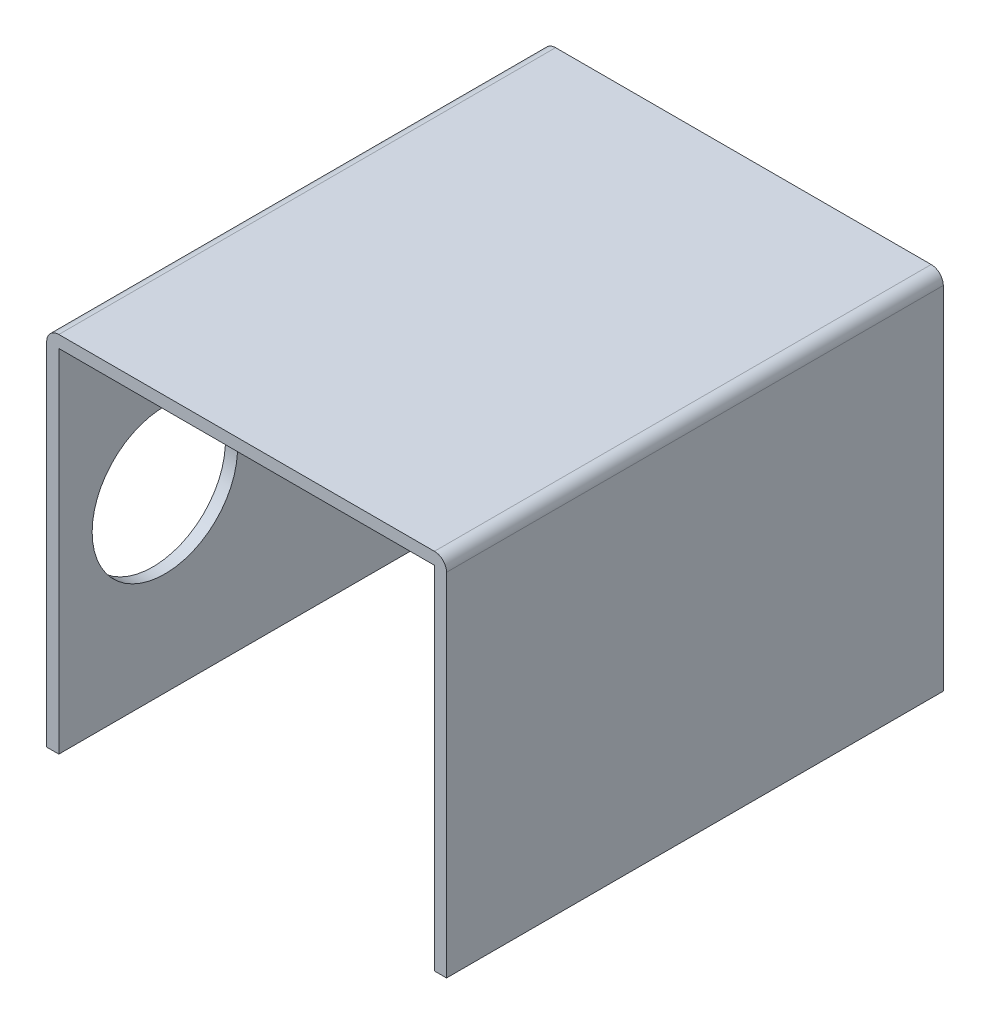
ISO-10303-21;
HEADER;
FILE_DESCRIPTION(('STEP AP214'),'2;1');
FILE_NAME('part.step','',(''),(''),'','','');
FILE_SCHEMA(('AUTOMOTIVE_DESIGN { 1 0 10303 214 1 1 1 1 }'));
ENDSEC;
DATA;
#1=APPLICATION_CONTEXT('core data for automotive mechanical design processes');
#2=APPLICATION_PROTOCOL_DEFINITION('international standard','automotive_design',2000,#1);
#3=PRODUCT_CONTEXT('',#1,'mechanical');
#4=PRODUCT('Part','Part','',(#3));
#5=PRODUCT_RELATED_PRODUCT_CATEGORY('part','',(#4));
#6=PRODUCT_DEFINITION_FORMATION('','',#4);
#7=PRODUCT_DEFINITION_CONTEXT('part definition',#1,'design');
#8=PRODUCT_DEFINITION('design','',#6,#7);
#9=PRODUCT_DEFINITION_SHAPE('','',#8);
#10=(LENGTH_UNIT() NAMED_UNIT(*) SI_UNIT(.MILLI.,.METRE.));
#11=(NAMED_UNIT(*) PLANE_ANGLE_UNIT() SI_UNIT($,.RADIAN.));
#12=(NAMED_UNIT(*) SI_UNIT($,.STERADIAN.) SOLID_ANGLE_UNIT());
#13=UNCERTAINTY_MEASURE_WITH_UNIT(LENGTH_MEASURE(1.E-05),#10,'distance_accuracy_value','');
#14=(GEOMETRIC_REPRESENTATION_CONTEXT(3) GLOBAL_UNCERTAINTY_ASSIGNED_CONTEXT((#13)) GLOBAL_UNIT_ASSIGNED_CONTEXT((#10,
#11,#12)) REPRESENTATION_CONTEXT('',''));
#15=CARTESIAN_POINT('',(0.,0.,0.));
#16=DIRECTION('',(0.,0.,1.));
#17=DIRECTION('',(1.,0.,0.));
#18=AXIS2_PLACEMENT_3D('',#15,#16,#17);
#19=CARTESIAN_POINT('',(32.,29.,41.));
#20=DIRECTION('',(1.,0.,0.));
#21=DIRECTION('',(0.,0.,-1.));
#22=AXIS2_PLACEMENT_3D('',#19,#20,#21);
#23=PLANE('',#22);
#24=DIRECTION('',(0.,1.,0.));
#25=VECTOR('',#24,1.);
#26=CARTESIAN_POINT('',(32.,29.,0.));
#27=LINE('',#26,#25);
#28=CARTESIAN_POINT('',(32.,29.,0.));
#29=VERTEX_POINT('',#28);
#30=CARTESIAN_POINT('',(32.,0.,0.));
#31=VERTEX_POINT('',#30);
#32=EDGE_CURVE('E144',#29,#31,#27,.F.);
#33=ORIENTED_EDGE('',*,*,#32,.T.);
#34=DIRECTION('',(0.,0.,-1.));
#35=VECTOR('',#34,1.);
#36=CARTESIAN_POINT('',(32.,0.,41.));
#37=LINE('',#36,#35);
#38=CARTESIAN_POINT('',(32.,0.,41.));
#39=VERTEX_POINT('',#38);
#40=EDGE_CURVE('E11',#39,#31,#37,.T.);
#41=ORIENTED_EDGE('',*,*,#40,.F.);
#42=DIRECTION('',(0.,1.,0.));
#43=VECTOR('',#42,1.);
#44=CARTESIAN_POINT('',(32.,29.,41.));
#45=LINE('',#44,#43);
#46=CARTESIAN_POINT('',(32.,29.,41.));
#47=VERTEX_POINT('',#46);
#48=EDGE_CURVE('E96',#47,#39,#45,.F.);
#49=ORIENTED_EDGE('',*,*,#48,.F.);
#50=DIRECTION('',(0.,0.,-1.));
#51=VECTOR('',#50,1.);
#52=CARTESIAN_POINT('',(32.,29.,41.));
#53=LINE('',#52,#51);
#54=EDGE_CURVE('E143',#47,#29,#53,.T.);
#55=ORIENTED_EDGE('',*,*,#54,.T.);
#56=EDGE_LOOP('',(#33,#41,#49,#55));
#57=FACE_BOUND('',#56,.T.);
#58=ADVANCED_FACE('F33',(#57),#23,.F.);
#59=CARTESIAN_POINT('',(33.,0.,41.));
#60=DIRECTION('',(0.,-1.,0.));
#61=DIRECTION('',(0.,0.,-1.));
#62=AXIS2_PLACEMENT_3D('',#59,#60,#61);
#63=PLANE('',#62);
#64=DIRECTION('',(-1.,0.,0.));
#65=VECTOR('',#64,1.);
#66=CARTESIAN_POINT('',(33.,0.,0.));
#67=LINE('',#66,#65);
#68=CARTESIAN_POINT('',(33.,0.,0.));
#69=VERTEX_POINT('',#68);
#70=EDGE_CURVE('E147',#69,#31,#67,.T.);
#71=ORIENTED_EDGE('',*,*,#70,.F.);
#72=DIRECTION('',(0.,0.,-1.));
#73=VECTOR('',#72,1.);
#74=CARTESIAN_POINT('',(33.,0.,41.));
#75=LINE('',#74,#73);
#76=CARTESIAN_POINT('',(33.,0.,41.));
#77=VERTEX_POINT('',#76);
#78=EDGE_CURVE('E42',#77,#69,#75,.T.);
#79=ORIENTED_EDGE('',*,*,#78,.F.);
#80=DIRECTION('',(-1.,0.,0.));
#81=VECTOR('',#80,1.);
#82=CARTESIAN_POINT('',(33.,0.,41.));
#83=LINE('',#82,#81);
#84=EDGE_CURVE('E193',#77,#39,#83,.T.);
#85=ORIENTED_EDGE('',*,*,#84,.T.);
#86=ORIENTED_EDGE('',*,*,#40,.T.);
#87=EDGE_LOOP('',(#71,#79,#85,#86));
#88=FACE_BOUND('',#87,.T.);
#89=ADVANCED_FACE('F231',(#88),#63,.T.);
#90=CARTESIAN_POINT('',(33.,29.,41.));
#91=DIRECTION('',(1.,0.,0.));
#92=DIRECTION('',(0.,0.,-1.));
#93=AXIS2_PLACEMENT_3D('',#90,#91,#92);
#94=PLANE('',#93);
#95=DIRECTION('',(0.,-1.,0.));
#96=VECTOR('',#95,1.);
#97=CARTESIAN_POINT('',(33.,29.,0.));
#98=LINE('',#97,#96);
#99=CARTESIAN_POINT('',(33.,29.,0.));
#100=VERTEX_POINT('',#99);
#101=EDGE_CURVE('E151',#100,#69,#98,.T.);
#102=ORIENTED_EDGE('',*,*,#101,.F.);
#103=DIRECTION('',(0.,0.,-1.));
#104=VECTOR('',#103,1.);
#105=CARTESIAN_POINT('',(33.,29.,41.));
#106=LINE('',#105,#104);
#107=CARTESIAN_POINT('',(33.,29.,41.));
#108=VERTEX_POINT('',#107);
#109=EDGE_CURVE('E178',#108,#100,#106,.T.);
#110=ORIENTED_EDGE('',*,*,#109,.F.);
#111=DIRECTION('',(0.,-1.,0.));
#112=VECTOR('',#111,1.);
#113=CARTESIAN_POINT('',(33.,29.,41.));
#114=LINE('',#113,#112);
#115=EDGE_CURVE('E196',#108,#77,#114,.T.);
#116=ORIENTED_EDGE('',*,*,#115,.T.);
#117=ORIENTED_EDGE('',*,*,#78,.T.);
#118=EDGE_LOOP('',(#102,#110,#116,#117));
#119=FACE_BOUND('',#118,.T.);
#120=ADVANCED_FACE('F235',(#119),#94,.T.);
#121=CARTESIAN_POINT('',(32.,29.,41.));
#122=DIRECTION('',(0.,0.,-1.));
#123=DIRECTION('',(-1.,0.,0.));
#124=AXIS2_PLACEMENT_3D('',#121,#122,#123);
#125=CYLINDRICAL_SURFACE('',#124,1.);
#126=CARTESIAN_POINT('',(32.,29.,0.));
#127=DIRECTION('',(0.,0.,-1.));
#128=DIRECTION('',(-1.,0.,0.));
#129=AXIS2_PLACEMENT_3D('',#126,#127,#128);
#130=CIRCLE('',#129,1.);
#131=CARTESIAN_POINT('',(32.,30.,0.));
#132=VERTEX_POINT('',#131);
#133=EDGE_CURVE('E154',#132,#100,#130,.T.);
#134=ORIENTED_EDGE('',*,*,#133,.F.);
#135=DIRECTION('',(0.,0.,-1.));
#136=VECTOR('',#135,1.);
#137=CARTESIAN_POINT('',(32.,30.,41.));
#138=LINE('',#137,#136);
#139=CARTESIAN_POINT('',(32.,30.,41.));
#140=VERTEX_POINT('',#139);
#141=EDGE_CURVE('E176',#140,#132,#138,.T.);
#142=ORIENTED_EDGE('',*,*,#141,.F.);
#143=CARTESIAN_POINT('',(32.,29.,41.));
#144=DIRECTION('',(0.,0.,-1.));
#145=DIRECTION('',(-1.,0.,0.));
#146=AXIS2_PLACEMENT_3D('',#143,#144,#145);
#147=CIRCLE('',#146,1.);
#148=EDGE_CURVE('E199',#140,#108,#147,.T.);
#149=ORIENTED_EDGE('',*,*,#148,.T.);
#150=ORIENTED_EDGE('',*,*,#109,.T.);
#151=EDGE_LOOP('',(#134,#142,#149,#150));
#152=FACE_BOUND('',#151,.T.);
#153=ADVANCED_FACE('F240',(#152),#125,.T.);
#154=CARTESIAN_POINT('',(1.00000000000001,30.,41.));
#155=DIRECTION('',(0.,1.,0.));
#156=DIRECTION('',(0.,0.,1.));
#157=AXIS2_PLACEMENT_3D('',#154,#155,#156);
#158=PLANE('',#157);
#159=DIRECTION('',(1.,0.,0.));
#160=VECTOR('',#159,1.);
#161=CARTESIAN_POINT('',(1.00000000000001,30.,0.));
#162=LINE('',#161,#160);
#163=CARTESIAN_POINT('',(1.00000000000001,30.,0.));
#164=VERTEX_POINT('',#163);
#165=EDGE_CURVE('E157',#164,#132,#162,.T.);
#166=ORIENTED_EDGE('',*,*,#165,.F.);
#167=DIRECTION('',(0.,0.,-1.));
#168=VECTOR('',#167,1.);
#169=CARTESIAN_POINT('',(1.00000000000001,30.,41.));
#170=LINE('',#169,#168);
#171=CARTESIAN_POINT('',(1.00000000000001,30.,41.));
#172=VERTEX_POINT('',#171);
#173=EDGE_CURVE('E174',#172,#164,#170,.T.);
#174=ORIENTED_EDGE('',*,*,#173,.F.);
#175=DIRECTION('',(1.,0.,0.));
#176=VECTOR('',#175,1.);
#177=CARTESIAN_POINT('',(1.00000000000001,30.,41.));
#178=LINE('',#177,#176);
#179=EDGE_CURVE('E202',#172,#140,#178,.T.);
#180=ORIENTED_EDGE('',*,*,#179,.T.);
#181=ORIENTED_EDGE('',*,*,#141,.T.);
#182=EDGE_LOOP('',(#166,#174,#180,#181));
#183=FACE_BOUND('',#182,.T.);
#184=ADVANCED_FACE('F246',(#183),#158,.T.);
#185=CARTESIAN_POINT('',(1.,29.,41.));
#186=DIRECTION('',(0.,0.,-1.));
#187=DIRECTION('',(-1.,0.,0.));
#188=AXIS2_PLACEMENT_3D('',#185,#186,#187);
#189=CYLINDRICAL_SURFACE('',#188,1.);
#190=CARTESIAN_POINT('',(1.,29.,0.));
#191=DIRECTION('',(0.,0.,-1.));
#192=DIRECTION('',(-1.,0.,0.));
#193=AXIS2_PLACEMENT_3D('',#190,#191,#192);
#194=CIRCLE('',#193,1.);
#195=CARTESIAN_POINT('',(0.,29.,0.));
#196=VERTEX_POINT('',#195);
#197=EDGE_CURVE('E160',#196,#164,#194,.T.);
#198=ORIENTED_EDGE('',*,*,#197,.F.);
#199=DIRECTION('',(0.,0.,-1.));
#200=VECTOR('',#199,1.);
#201=CARTESIAN_POINT('',(0.,29.,41.));
#202=LINE('',#201,#200);
#203=CARTESIAN_POINT('',(0.,29.,41.));
#204=VERTEX_POINT('',#203);
#205=EDGE_CURVE('E172',#204,#196,#202,.T.);
#206=ORIENTED_EDGE('',*,*,#205,.F.);
#207=CARTESIAN_POINT('',(1.,29.,41.));
#208=DIRECTION('',(0.,0.,-1.));
#209=DIRECTION('',(-1.,0.,0.));
#210=AXIS2_PLACEMENT_3D('',#207,#208,#209);
#211=CIRCLE('',#210,1.);
#212=EDGE_CURVE('E138',#204,#172,#211,.T.);
#213=ORIENTED_EDGE('',*,*,#212,.T.);
#214=ORIENTED_EDGE('',*,*,#173,.T.);
#215=EDGE_LOOP('',(#198,#206,#213,#214));
#216=FACE_BOUND('',#215,.T.);
#217=ADVANCED_FACE('F207',(#216),#189,.T.);
#218=CARTESIAN_POINT('',(0.,0.,41.));
#219=DIRECTION('',(-1.,0.,0.));
#220=DIRECTION('',(0.,0.,1.));
#221=AXIS2_PLACEMENT_3D('',#218,#219,#220);
#222=PLANE('',#221);
#223=CARTESIAN_POINT('',(0.,14.5,32.25));
#224=DIRECTION('',(-1.,0.,0.));
#225=DIRECTION('',(0.,0.,1.));
#226=AXIS2_PLACEMENT_3D('',#223,#224,#225);
#227=CIRCLE('',#226,6.);
#228=CARTESIAN_POINT('',(0.,14.5,38.25));
#229=VERTEX_POINT('',#228);
#230=EDGE_CURVE('E189',#229,#229,#227,.T.);
#231=ORIENTED_EDGE('',*,*,#230,.F.);
#232=EDGE_LOOP('',(#231));
#233=FACE_BOUND('',#232,.T.);
#234=CARTESIAN_POINT('',(0.,14.5,8.75));
#235=DIRECTION('',(1.,0.,0.));
#236=DIRECTION('',(0.,0.,-1.));
#237=AXIS2_PLACEMENT_3D('',#234,#235,#236);
#238=CIRCLE('',#237,3.);
#239=CARTESIAN_POINT('',(0.,14.5,5.75));
#240=VERTEX_POINT('',#239);
#241=EDGE_CURVE('E181',#240,#240,#238,.T.);
#242=ORIENTED_EDGE('',*,*,#241,.T.);
#243=EDGE_LOOP('',(#242));
#244=FACE_BOUND('',#243,.T.);
#245=DIRECTION('',(0.,1.,0.));
#246=VECTOR('',#245,1.);
#247=CARTESIAN_POINT('',(0.,0.,0.));
#248=LINE('',#247,#246);
#249=CARTESIAN_POINT('',(0.,0.,0.));
#250=VERTEX_POINT('',#249);
#251=EDGE_CURVE('E163',#250,#196,#248,.T.);
#252=ORIENTED_EDGE('',*,*,#251,.F.);
#253=DIRECTION('',(0.,0.,-1.));
#254=VECTOR('',#253,1.);
#255=CARTESIAN_POINT('',(0.,0.,41.));
#256=LINE('',#255,#254);
#257=CARTESIAN_POINT('',(0.,0.,41.));
#258=VERTEX_POINT('',#257);
#259=EDGE_CURVE('E126',#258,#250,#256,.T.);
#260=ORIENTED_EDGE('',*,*,#259,.F.);
#261=DIRECTION('',(0.,1.,0.));
#262=VECTOR('',#261,1.);
#263=CARTESIAN_POINT('',(0.,0.,41.));
#264=LINE('',#263,#262);
#265=EDGE_CURVE('E136',#258,#204,#264,.T.);
#266=ORIENTED_EDGE('',*,*,#265,.T.);
#267=ORIENTED_EDGE('',*,*,#205,.T.);
#268=EDGE_LOOP('',(#252,#260,#266,#267));
#269=FACE_BOUND('',#268,.T.);
#270=ADVANCED_FACE('F213',(#233,#244,#269),#222,.T.);
#271=CARTESIAN_POINT('',(1.,0.,41.));
#272=DIRECTION('',(0.,-1.,0.));
#273=DIRECTION('',(0.,0.,-1.));
#274=AXIS2_PLACEMENT_3D('',#271,#272,#273);
#275=PLANE('',#274);
#276=DIRECTION('',(-1.,0.,0.));
#277=VECTOR('',#276,1.);
#278=CARTESIAN_POINT('',(1.,0.,0.));
#279=LINE('',#278,#277);
#280=CARTESIAN_POINT('',(1.,0.,0.));
#281=VERTEX_POINT('',#280);
#282=EDGE_CURVE('E125',#281,#250,#279,.T.);
#283=ORIENTED_EDGE('',*,*,#282,.F.);
#284=DIRECTION('',(0.,0.,-1.));
#285=VECTOR('',#284,1.);
#286=CARTESIAN_POINT('',(1.,0.,41.));
#287=LINE('',#286,#285);
#288=CARTESIAN_POINT('',(1.,0.,41.));
#289=VERTEX_POINT('',#288);
#290=EDGE_CURVE('E119',#289,#281,#287,.T.);
#291=ORIENTED_EDGE('',*,*,#290,.F.);
#292=DIRECTION('',(-1.,0.,0.));
#293=VECTOR('',#292,1.);
#294=CARTESIAN_POINT('',(1.,0.,41.));
#295=LINE('',#294,#293);
#296=EDGE_CURVE('E123',#289,#258,#295,.T.);
#297=ORIENTED_EDGE('',*,*,#296,.T.);
#298=ORIENTED_EDGE('',*,*,#259,.T.);
#299=EDGE_LOOP('',(#283,#291,#297,#298));
#300=FACE_BOUND('',#299,.T.);
#301=ADVANCED_FACE('F121',(#300),#275,.T.);
#302=CARTESIAN_POINT('',(1.,0.,41.));
#303=DIRECTION('',(-1.,0.,0.));
#304=DIRECTION('',(0.,0.,1.));
#305=AXIS2_PLACEMENT_3D('',#302,#303,#304);
#306=PLANE('',#305);
#307=CARTESIAN_POINT('',(1.,14.5,32.25));
#308=DIRECTION('',(-1.,0.,0.));
#309=DIRECTION('',(0.,0.,1.));
#310=AXIS2_PLACEMENT_3D('',#307,#308,#309);
#311=CIRCLE('',#310,6.);
#312=CARTESIAN_POINT('',(1.,14.5,38.25));
#313=VERTEX_POINT('',#312);
#314=EDGE_CURVE('E36',#313,#313,#311,.T.);
#315=ORIENTED_EDGE('',*,*,#314,.T.);
#316=EDGE_LOOP('',(#315));
#317=FACE_BOUND('',#316,.T.);
#318=CARTESIAN_POINT('',(1.,14.5,8.75));
#319=DIRECTION('',(-1.,0.,0.));
#320=DIRECTION('',(0.,0.,1.));
#321=AXIS2_PLACEMENT_3D('',#318,#319,#320);
#322=CIRCLE('',#321,3.);
#323=CARTESIAN_POINT('',(1.,14.5,11.75));
#324=VERTEX_POINT('',#323);
#325=EDGE_CURVE('E148',#324,#324,#322,.F.);
#326=ORIENTED_EDGE('',*,*,#325,.F.);
#327=EDGE_LOOP('',(#326));
#328=FACE_BOUND('',#327,.T.);
#329=DIRECTION('',(0.,1.,0.));
#330=VECTOR('',#329,1.);
#331=CARTESIAN_POINT('',(1.,0.,0.));
#332=LINE('',#331,#330);
#333=CARTESIAN_POINT('',(1.,29.,0.));
#334=VERTEX_POINT('',#333);
#335=EDGE_CURVE('E84',#281,#334,#332,.T.);
#336=ORIENTED_EDGE('',*,*,#335,.T.);
#337=DIRECTION('',(0.,0.,-1.));
#338=VECTOR('',#337,1.);
#339=CARTESIAN_POINT('',(1.,29.,41.));
#340=LINE('',#339,#338);
#341=CARTESIAN_POINT('',(1.,29.,41.));
#342=VERTEX_POINT('',#341);
#343=EDGE_CURVE('E127',#342,#334,#340,.T.);
#344=ORIENTED_EDGE('',*,*,#343,.F.);
#345=DIRECTION('',(0.,1.,0.));
#346=VECTOR('',#345,1.);
#347=CARTESIAN_POINT('',(1.,0.,41.));
#348=LINE('',#347,#346);
#349=EDGE_CURVE('E129',#289,#342,#348,.T.);
#350=ORIENTED_EDGE('',*,*,#349,.F.);
#351=ORIENTED_EDGE('',*,*,#290,.T.);
#352=EDGE_LOOP('',(#336,#344,#350,#351));
#353=FACE_BOUND('',#352,.T.);
#354=ADVANCED_FACE('F130',(#317,#328,#353),#306,.F.);
#355=CARTESIAN_POINT('',(1.00000000000001,29.,41.));
#356=DIRECTION('',(0.,1.,0.));
#357=DIRECTION('',(0.,0.,1.));
#358=AXIS2_PLACEMENT_3D('',#355,#356,#357);
#359=PLANE('',#358);
#360=DIRECTION('',(1.,0.,0.));
#361=VECTOR('',#360,1.);
#362=CARTESIAN_POINT('',(1.00000000000001,29.,0.));
#363=LINE('',#362,#361);
#364=EDGE_CURVE('E90',#334,#29,#363,.T.);
#365=ORIENTED_EDGE('',*,*,#364,.T.);
#366=ORIENTED_EDGE('',*,*,#54,.F.);
#367=DIRECTION('',(1.,0.,0.));
#368=VECTOR('',#367,1.);
#369=CARTESIAN_POINT('',(1.00000000000001,29.,41.));
#370=LINE('',#369,#368);
#371=EDGE_CURVE('E51',#342,#47,#370,.T.);
#372=ORIENTED_EDGE('',*,*,#371,.F.);
#373=ORIENTED_EDGE('',*,*,#343,.T.);
#374=EDGE_LOOP('',(#365,#366,#372,#373));
#375=FACE_BOUND('',#374,.T.);
#376=ADVANCED_FACE('F219',(#375),#359,.F.);
#377=CARTESIAN_POINT('',(32.,29.,41.));
#378=DIRECTION('',(0.,0.,-1.));
#379=DIRECTION('',(-1.,0.,0.));
#380=AXIS2_PLACEMENT_3D('',#377,#378,#379);
#381=PLANE('',#380);
#382=ORIENTED_EDGE('',*,*,#48,.T.);
#383=ORIENTED_EDGE('',*,*,#84,.F.);
#384=ORIENTED_EDGE('',*,*,#115,.F.);
#385=ORIENTED_EDGE('',*,*,#148,.F.);
#386=ORIENTED_EDGE('',*,*,#179,.F.);
#387=ORIENTED_EDGE('',*,*,#212,.F.);
#388=ORIENTED_EDGE('',*,*,#265,.F.);
#389=ORIENTED_EDGE('',*,*,#296,.F.);
#390=ORIENTED_EDGE('',*,*,#349,.T.);
#391=ORIENTED_EDGE('',*,*,#371,.T.);
#392=EDGE_LOOP('',(#382,#383,#384,#385,#386,#387,#388,#389,#390,#391));
#393=FACE_BOUND('',#392,.T.);
#394=ADVANCED_FACE('F133',(#393),#381,.F.);
#395=CARTESIAN_POINT('',(32.,29.,0.));
#396=DIRECTION('',(0.,0.,-1.));
#397=DIRECTION('',(-1.,0.,0.));
#398=AXIS2_PLACEMENT_3D('',#395,#396,#397);
#399=PLANE('',#398);
#400=ORIENTED_EDGE('',*,*,#32,.F.);
#401=ORIENTED_EDGE('',*,*,#364,.F.);
#402=ORIENTED_EDGE('',*,*,#335,.F.);
#403=ORIENTED_EDGE('',*,*,#282,.T.);
#404=ORIENTED_EDGE('',*,*,#251,.T.);
#405=ORIENTED_EDGE('',*,*,#197,.T.);
#406=ORIENTED_EDGE('',*,*,#165,.T.);
#407=ORIENTED_EDGE('',*,*,#133,.T.);
#408=ORIENTED_EDGE('',*,*,#101,.T.);
#409=ORIENTED_EDGE('',*,*,#70,.T.);
#410=EDGE_LOOP('',(#400,#401,#402,#403,#404,#405,#406,#407,#408,#409));
#411=FACE_BOUND('',#410,.T.);
#412=ADVANCED_FACE('F216',(#411),#399,.T.);
#413=CARTESIAN_POINT('',(5.,14.5,8.75));
#414=DIRECTION('',(-1.,0.,0.));
#415=DIRECTION('',(0.,0.,1.));
#416=AXIS2_PLACEMENT_3D('',#413,#414,#415);
#417=CYLINDRICAL_SURFACE('',#416,3.);
#418=ORIENTED_EDGE('',*,*,#241,.F.);
#419=EDGE_LOOP('',(#418));
#420=FACE_BOUND('',#419,.T.);
#421=ORIENTED_EDGE('',*,*,#325,.T.);
#422=EDGE_LOOP('',(#421));
#423=FACE_BOUND('',#422,.T.);
#424=ADVANCED_FACE('F279',(#420,#423),#417,.F.);
#425=CARTESIAN_POINT('',(22.,14.5,32.25));
#426=DIRECTION('',(-1.,0.,0.));
#427=DIRECTION('',(0.,0.,1.));
#428=AXIS2_PLACEMENT_3D('',#425,#426,#427);
#429=CYLINDRICAL_SURFACE('',#428,6.);
#430=ORIENTED_EDGE('',*,*,#230,.T.);
#431=EDGE_LOOP('',(#430));
#432=FACE_BOUND('',#431,.T.);
#433=ORIENTED_EDGE('',*,*,#314,.F.);
#434=EDGE_LOOP('',(#433));
#435=FACE_BOUND('',#434,.T.);
#436=ADVANCED_FACE('F275',(#432,#435),#429,.F.);
#437=CLOSED_SHELL('',(#58,#89,#120,#153,#184,#217,#270,#301,#354,#376,#394,#412,#424,#436));
#438=MANIFOLD_SOLID_BREP('B2',#437);
#439=ADVANCED_BREP_SHAPE_REPRESENTATION('',(#18,#438),#14);
#440=SHAPE_DEFINITION_REPRESENTATION(#9,#439);
ENDSEC;
END-ISO-10303-21;
